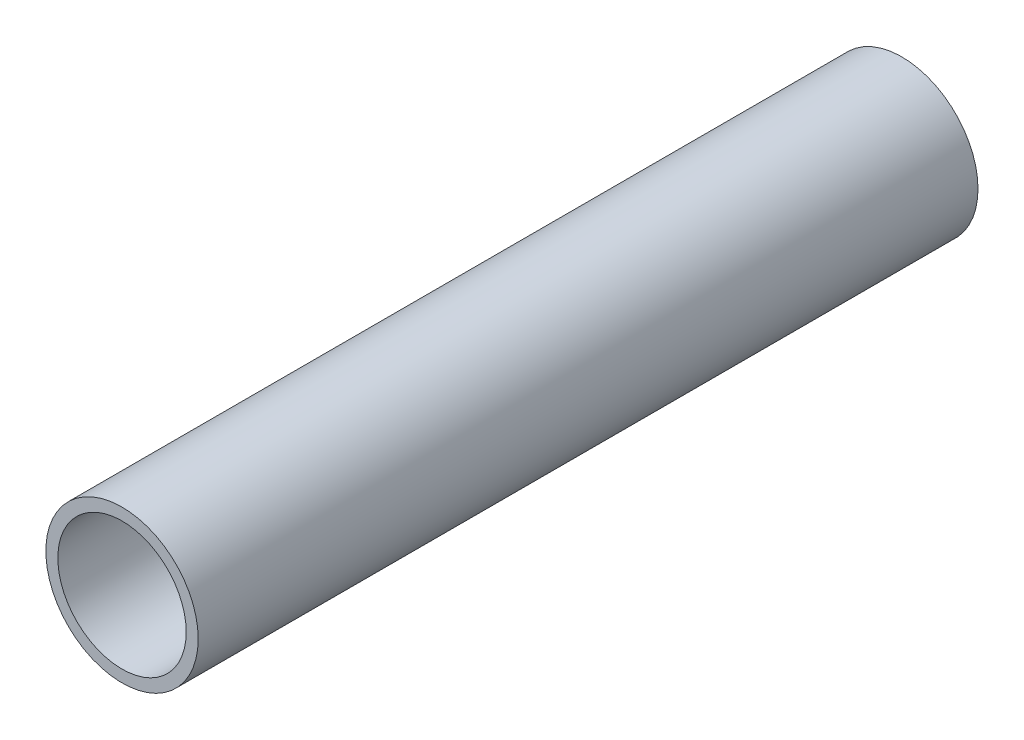
ISO-10303-21;
HEADER;
FILE_DESCRIPTION(('STEP AP214'),'2;1');
FILE_NAME('part.step','',(''),(''),'','','');
FILE_SCHEMA(('AUTOMOTIVE_DESIGN { 1 0 10303 214 1 1 1 1 }'));
ENDSEC;
DATA;
#1=APPLICATION_CONTEXT('core data for automotive mechanical design processes');
#2=APPLICATION_PROTOCOL_DEFINITION('international standard','automotive_design',2000,#1);
#3=PRODUCT_CONTEXT('',#1,'mechanical');
#4=PRODUCT('Part','Part','',(#3));
#5=PRODUCT_RELATED_PRODUCT_CATEGORY('part','',(#4));
#6=PRODUCT_DEFINITION_FORMATION('','',#4);
#7=PRODUCT_DEFINITION_CONTEXT('part definition',#1,'design');
#8=PRODUCT_DEFINITION('design','',#6,#7);
#9=PRODUCT_DEFINITION_SHAPE('','',#8);
#10=(LENGTH_UNIT() NAMED_UNIT(*) SI_UNIT(.MILLI.,.METRE.));
#11=(NAMED_UNIT(*) PLANE_ANGLE_UNIT() SI_UNIT($,.RADIAN.));
#12=(NAMED_UNIT(*) SI_UNIT($,.STERADIAN.) SOLID_ANGLE_UNIT());
#13=UNCERTAINTY_MEASURE_WITH_UNIT(LENGTH_MEASURE(1.E-05),#10,'distance_accuracy_value','');
#14=(GEOMETRIC_REPRESENTATION_CONTEXT(3) GLOBAL_UNCERTAINTY_ASSIGNED_CONTEXT((#13)) GLOBAL_UNIT_ASSIGNED_CONTEXT((#10,
#11,#12)) REPRESENTATION_CONTEXT('',''));
#15=CARTESIAN_POINT('',(0.,0.,0.));
#16=DIRECTION('',(0.,0.,1.));
#17=DIRECTION('',(1.,0.,0.));
#18=AXIS2_PLACEMENT_3D('',#15,#16,#17);
#19=CARTESIAN_POINT('',(0.,0.,-130.));
#20=DIRECTION('',(0.,0.,-1.));
#21=DIRECTION('',(1.,0.,0.));
#22=AXIS2_PLACEMENT_3D('',#19,#20,#21);
#23=PLANE('',#22);
#24=CARTESIAN_POINT('',(0.,0.,-130.));
#25=DIRECTION('',(0.,0.,1.));
#26=DIRECTION('',(1.,0.,0.));
#27=AXIS2_PLACEMENT_3D('',#24,#25,#26);
#28=CIRCLE('',#27,12.7);
#29=CARTESIAN_POINT('',(12.7,0.,-130.));
#30=VERTEX_POINT('',#29);
#31=EDGE_CURVE('E10',#30,#30,#28,.T.);
#32=ORIENTED_EDGE('',*,*,#31,.F.);
#33=EDGE_LOOP('',(#32));
#34=FACE_BOUND('',#33,.T.);
#35=CARTESIAN_POINT('',(0.,0.,-130.));
#36=DIRECTION('',(0.,0.,1.));
#37=DIRECTION('',(1.,0.,0.));
#38=AXIS2_PLACEMENT_3D('',#35,#36,#37);
#39=CIRCLE('',#38,10.7);
#40=CARTESIAN_POINT('',(10.7,0.,-130.));
#41=VERTEX_POINT('',#40);
#42=EDGE_CURVE('E48',#41,#41,#39,.T.);
#43=ORIENTED_EDGE('',*,*,#42,.T.);
#44=EDGE_LOOP('',(#43));
#45=FACE_BOUND('',#44,.T.);
#46=ADVANCED_FACE('F37',(#34,#45),#23,.T.);
#47=CARTESIAN_POINT('',(0.,0.,0.));
#48=DIRECTION('',(0.,0.,-1.));
#49=DIRECTION('',(1.,0.,0.));
#50=AXIS2_PLACEMENT_3D('',#47,#48,#49);
#51=PLANE('',#50);
#52=CARTESIAN_POINT('',(0.,0.,0.));
#53=DIRECTION('',(0.,0.,1.));
#54=DIRECTION('',(1.,0.,0.));
#55=AXIS2_PLACEMENT_3D('',#52,#53,#54);
#56=CIRCLE('',#55,12.7);
#57=CARTESIAN_POINT('',(12.7,0.,0.));
#58=VERTEX_POINT('',#57);
#59=EDGE_CURVE('E41',#58,#58,#56,.T.);
#60=ORIENTED_EDGE('',*,*,#59,.T.);
#61=EDGE_LOOP('',(#60));
#62=FACE_BOUND('',#61,.T.);
#63=CARTESIAN_POINT('',(0.,0.,0.));
#64=DIRECTION('',(0.,0.,1.));
#65=DIRECTION('',(1.,0.,0.));
#66=AXIS2_PLACEMENT_3D('',#63,#64,#65);
#67=CIRCLE('',#66,10.7);
#68=CARTESIAN_POINT('',(10.7,0.,0.));
#69=VERTEX_POINT('',#68);
#70=EDGE_CURVE('E50',#69,#69,#67,.T.);
#71=ORIENTED_EDGE('',*,*,#70,.F.);
#72=EDGE_LOOP('',(#71));
#73=FACE_BOUND('',#72,.T.);
#74=ADVANCED_FACE('F63',(#62,#73),#51,.F.);
#75=CARTESIAN_POINT('',(0.,0.,-130.));
#76=DIRECTION('',(0.,0.,1.));
#77=DIRECTION('',(-1.,0.,0.));
#78=AXIS2_PLACEMENT_3D('',#75,#76,#77);
#79=CYLINDRICAL_SURFACE('',#78,12.7);
#80=ORIENTED_EDGE('',*,*,#31,.T.);
#81=EDGE_LOOP('',(#80));
#82=FACE_BOUND('',#81,.T.);
#83=ORIENTED_EDGE('',*,*,#59,.F.);
#84=EDGE_LOOP('',(#83));
#85=FACE_BOUND('',#84,.T.);
#86=ADVANCED_FACE('F39',(#82,#85),#79,.T.);
#87=CARTESIAN_POINT('',(0.,0.,-130.));
#88=DIRECTION('',(0.,0.,1.));
#89=DIRECTION('',(-1.,0.,0.));
#90=AXIS2_PLACEMENT_3D('',#87,#88,#89);
#91=CYLINDRICAL_SURFACE('',#90,10.7);
#92=ORIENTED_EDGE('',*,*,#42,.F.);
#93=EDGE_LOOP('',(#92));
#94=FACE_BOUND('',#93,.T.);
#95=ORIENTED_EDGE('',*,*,#70,.T.);
#96=EDGE_LOOP('',(#95));
#97=FACE_BOUND('',#96,.T.);
#98=ADVANCED_FACE('F57',(#94,#97),#91,.F.);
#99=CLOSED_SHELL('',(#46,#74,#86,#98));
#100=MANIFOLD_SOLID_BREP('B2',#99);
#101=ADVANCED_BREP_SHAPE_REPRESENTATION('',(#18,#100),#14);
#102=SHAPE_DEFINITION_REPRESENTATION(#9,#101);
ENDSEC;
END-ISO-10303-21;
